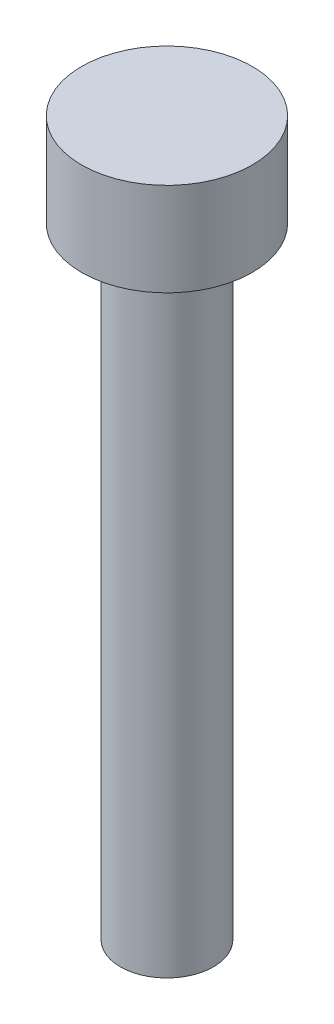
ISO-10303-21;
HEADER;
FILE_DESCRIPTION(('STEP AP214'),'2;1');
FILE_NAME('part.step','',(''),(''),'','','');
FILE_SCHEMA(('AUTOMOTIVE_DESIGN { 1 0 10303 214 1 1 1 1 }'));
ENDSEC;
DATA;
#1=APPLICATION_CONTEXT('core data for automotive mechanical design processes');
#2=APPLICATION_PROTOCOL_DEFINITION('international standard','automotive_design',2000,#1);
#3=PRODUCT_CONTEXT('',#1,'mechanical');
#4=PRODUCT('Part','Part','',(#3));
#5=PRODUCT_RELATED_PRODUCT_CATEGORY('part','',(#4));
#6=PRODUCT_DEFINITION_FORMATION('','',#4);
#7=PRODUCT_DEFINITION_CONTEXT('part definition',#1,'design');
#8=PRODUCT_DEFINITION('design','',#6,#7);
#9=PRODUCT_DEFINITION_SHAPE('','',#8);
#10=(LENGTH_UNIT() NAMED_UNIT(*) SI_UNIT(.MILLI.,.METRE.));
#11=(NAMED_UNIT(*) PLANE_ANGLE_UNIT() SI_UNIT($,.RADIAN.));
#12=(NAMED_UNIT(*) SI_UNIT($,.STERADIAN.) SOLID_ANGLE_UNIT());
#13=UNCERTAINTY_MEASURE_WITH_UNIT(LENGTH_MEASURE(1.E-05),#10,'distance_accuracy_value','');
#14=(GEOMETRIC_REPRESENTATION_CONTEXT(3) GLOBAL_UNCERTAINTY_ASSIGNED_CONTEXT((#13)) GLOBAL_UNIT_ASSIGNED_CONTEXT((#10,
#11,#12)) REPRESENTATION_CONTEXT('',''));
#15=CARTESIAN_POINT('',(0.,0.,0.));
#16=DIRECTION('',(0.,0.,1.));
#17=DIRECTION('',(1.,0.,0.));
#18=AXIS2_PLACEMENT_3D('',#15,#16,#17);
#19=CARTESIAN_POINT('',(0.,20.,0.));
#20=DIRECTION('',(0.,-1.,0.));
#21=DIRECTION('',(0.,0.,-1.));
#22=AXIS2_PLACEMENT_3D('',#19,#20,#21);
#23=CYLINDRICAL_SURFACE('',#22,1.5);
#24=CARTESIAN_POINT('',(0.,20.,0.));
#25=DIRECTION('',(0.,1.,0.));
#26=DIRECTION('',(0.,0.,1.));
#27=AXIS2_PLACEMENT_3D('',#24,#25,#26);
#28=CIRCLE('',#27,1.5);
#29=CARTESIAN_POINT('',(0.,20.,1.5));
#30=VERTEX_POINT('',#29);
#31=EDGE_CURVE('E10',#30,#30,#28,.T.);
#32=ORIENTED_EDGE('',*,*,#31,.F.);
#33=EDGE_LOOP('',(#32));
#34=FACE_BOUND('',#33,.T.);
#35=CARTESIAN_POINT('',(0.,0.,0.));
#36=DIRECTION('',(0.,1.,0.));
#37=DIRECTION('',(0.,0.,1.));
#38=AXIS2_PLACEMENT_3D('',#35,#36,#37);
#39=CIRCLE('',#38,1.5);
#40=CARTESIAN_POINT('',(0.,0.,1.5));
#41=VERTEX_POINT('',#40);
#42=EDGE_CURVE('E38',#41,#41,#39,.T.);
#43=ORIENTED_EDGE('',*,*,#42,.T.);
#44=EDGE_LOOP('',(#43));
#45=FACE_BOUND('',#44,.T.);
#46=ADVANCED_FACE('F35',(#34,#45),#23,.T.);
#47=CARTESIAN_POINT('',(0.,0.,0.));
#48=DIRECTION('',(0.,1.,0.));
#49=DIRECTION('',(0.,0.,1.));
#50=AXIS2_PLACEMENT_3D('',#47,#48,#49);
#51=PLANE('',#50);
#52=ORIENTED_EDGE('',*,*,#42,.F.);
#53=EDGE_LOOP('',(#52));
#54=FACE_BOUND('',#53,.T.);
#55=ADVANCED_FACE('F58',(#54),#51,.F.);
#56=CARTESIAN_POINT('',(0.,23.,0.));
#57=DIRECTION('',(0.,-1.,0.));
#58=DIRECTION('',(0.,0.,-1.));
#59=AXIS2_PLACEMENT_3D('',#56,#57,#58);
#60=CYLINDRICAL_SURFACE('',#59,2.75);
#61=CARTESIAN_POINT('',(0.,23.,0.));
#62=DIRECTION('',(0.,1.,0.));
#63=DIRECTION('',(0.,0.,1.));
#64=AXIS2_PLACEMENT_3D('',#61,#62,#63);
#65=CIRCLE('',#64,2.75);
#66=CARTESIAN_POINT('',(0.,23.,2.75));
#67=VERTEX_POINT('',#66);
#68=EDGE_CURVE('E45',#67,#67,#65,.T.);
#69=ORIENTED_EDGE('',*,*,#68,.F.);
#70=EDGE_LOOP('',(#69));
#71=FACE_BOUND('',#70,.T.);
#72=CARTESIAN_POINT('',(0.,20.,0.));
#73=DIRECTION('',(0.,1.,0.));
#74=DIRECTION('',(0.,0.,1.));
#75=AXIS2_PLACEMENT_3D('',#72,#73,#74);
#76=CIRCLE('',#75,2.75);
#77=CARTESIAN_POINT('',(0.,20.,2.75));
#78=VERTEX_POINT('',#77);
#79=EDGE_CURVE('E47',#78,#78,#76,.T.);
#80=ORIENTED_EDGE('',*,*,#79,.T.);
#81=EDGE_LOOP('',(#80));
#82=FACE_BOUND('',#81,.T.);
#83=ADVANCED_FACE('F55',(#71,#82),#60,.T.);
#84=CARTESIAN_POINT('',(0.,23.,0.));
#85=DIRECTION('',(0.,1.,0.));
#86=DIRECTION('',(0.,0.,1.));
#87=AXIS2_PLACEMENT_3D('',#84,#85,#86);
#88=PLANE('',#87);
#89=ORIENTED_EDGE('',*,*,#68,.T.);
#90=EDGE_LOOP('',(#89));
#91=FACE_BOUND('',#90,.T.);
#92=ADVANCED_FACE('F53',(#91),#88,.T.);
#93=CARTESIAN_POINT('',(0.,20.,0.));
#94=DIRECTION('',(0.,1.,0.));
#95=DIRECTION('',(0.,0.,1.));
#96=AXIS2_PLACEMENT_3D('',#93,#94,#95);
#97=PLANE('',#96);
#98=ORIENTED_EDGE('',*,*,#31,.T.);
#99=EDGE_LOOP('',(#98));
#100=FACE_BOUND('',#99,.T.);
#101=ORIENTED_EDGE('',*,*,#79,.F.);
#102=EDGE_LOOP('',(#101));
#103=FACE_BOUND('',#102,.T.);
#104=ADVANCED_FACE('F62',(#100,#103),#97,.F.);
#105=CLOSED_SHELL('',(#46,#55,#83,#92,#104));
#106=MANIFOLD_SOLID_BREP('B2',#105);
#107=ADVANCED_BREP_SHAPE_REPRESENTATION('',(#18,#106),#14);
#108=SHAPE_DEFINITION_REPRESENTATION(#9,#107);
ENDSEC;
END-ISO-10303-21;
